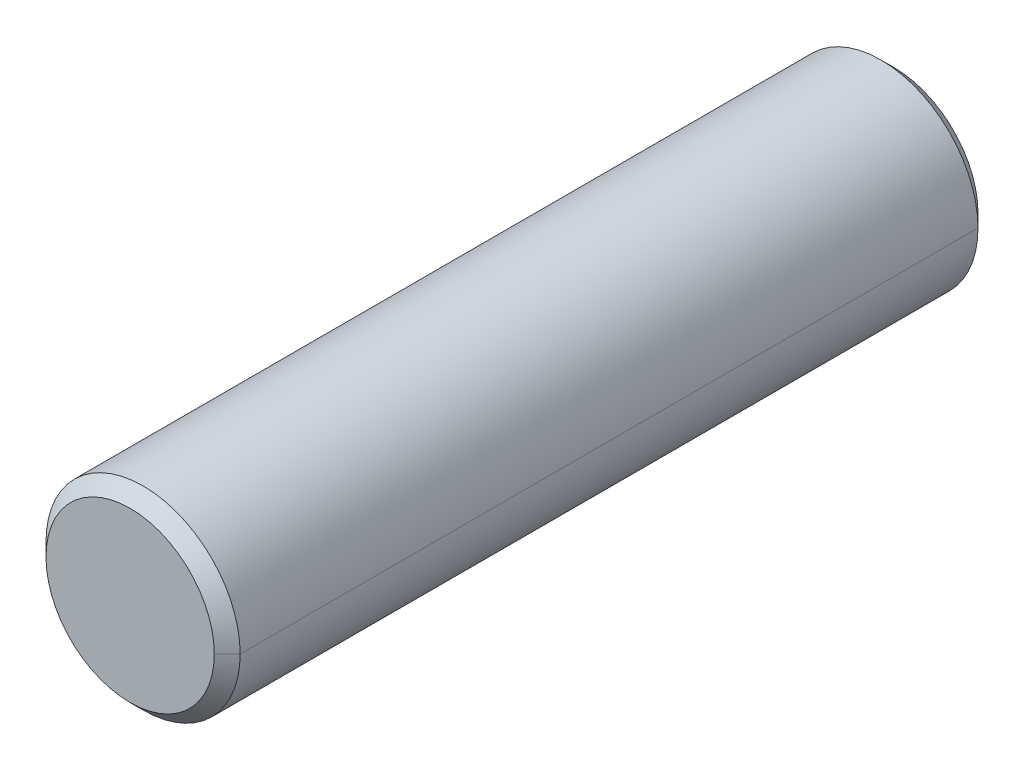
ISO-10303-21;
HEADER;
FILE_DESCRIPTION(('STEP AP214'),'2;1');
FILE_NAME('part.step','',(''),(''),'','','');
FILE_SCHEMA(('AUTOMOTIVE_DESIGN { 1 0 10303 214 1 1 1 1 }'));
ENDSEC;
DATA;
#1=APPLICATION_CONTEXT('core data for automotive mechanical design processes');
#2=APPLICATION_PROTOCOL_DEFINITION('international standard','automotive_design',2000,#1);
#3=PRODUCT_CONTEXT('',#1,'mechanical');
#4=PRODUCT('Part','Part','',(#3));
#5=PRODUCT_RELATED_PRODUCT_CATEGORY('part','',(#4));
#6=PRODUCT_DEFINITION_FORMATION('','',#4);
#7=PRODUCT_DEFINITION_CONTEXT('part definition',#1,'design');
#8=PRODUCT_DEFINITION('design','',#6,#7);
#9=PRODUCT_DEFINITION_SHAPE('','',#8);
#10=(LENGTH_UNIT() NAMED_UNIT(*) SI_UNIT(.MILLI.,.METRE.));
#11=(NAMED_UNIT(*) PLANE_ANGLE_UNIT() SI_UNIT($,.RADIAN.));
#12=(NAMED_UNIT(*) SI_UNIT($,.STERADIAN.) SOLID_ANGLE_UNIT());
#13=UNCERTAINTY_MEASURE_WITH_UNIT(LENGTH_MEASURE(1.E-05),#10,'distance_accuracy_value','');
#14=(GEOMETRIC_REPRESENTATION_CONTEXT(3) GLOBAL_UNCERTAINTY_ASSIGNED_CONTEXT((#13)) GLOBAL_UNIT_ASSIGNED_CONTEXT((#10,
#11,#12)) REPRESENTATION_CONTEXT('',''));
#15=CARTESIAN_POINT('',(0.,0.,0.));
#16=DIRECTION('',(0.,0.,1.));
#17=DIRECTION('',(1.,0.,0.));
#18=AXIS2_PLACEMENT_3D('',#15,#16,#17);
#19=CARTESIAN_POINT('',(0.,0.,-59.));
#20=DIRECTION('',(0.,0.,1.));
#21=DIRECTION('',(1.,0.,0.));
#22=AXIS2_PLACEMENT_3D('',#19,#20,#21);
#23=PLANE('',#22);
#24=CARTESIAN_POINT('',(0.,0.,-59.));
#25=DIRECTION('',(0.,0.,-1.));
#26=DIRECTION('',(-1.,0.,0.));
#27=AXIS2_PLACEMENT_3D('',#24,#25,#26);
#28=CIRCLE('',#27,13.);
#29=CARTESIAN_POINT('',(-12.9999999995967,-3.416070516846E-08,-59.0000000004033));
#30=VERTEX_POINT('',#29);
#31=CARTESIAN_POINT('',(12.9999999995967,3.41607067926625E-08,-59.0000000004033));
#32=VERTEX_POINT('',#31);
#33=EDGE_CURVE('E11',#30,#32,#28,.T.);
#34=ORIENTED_EDGE('',*,*,#33,.T.);
#35=CARTESIAN_POINT('',(0.,0.,-59.));
#36=DIRECTION('',(0.,0.,-1.));
#37=DIRECTION('',(1.,0.,0.));
#38=AXIS2_PLACEMENT_3D('',#35,#36,#37);
#39=CIRCLE('',#38,13.);
#40=EDGE_CURVE('E26',#32,#30,#39,.T.);
#41=ORIENTED_EDGE('',*,*,#40,.T.);
#42=EDGE_LOOP('',(#34,#41));
#43=FACE_BOUND('',#42,.T.);
#44=ADVANCED_FACE('F16',(#43),#23,.F.);
#45=CARTESIAN_POINT('',(0.,0.,-71.));
#46=DIRECTION('',(0.,0.,1.));
#47=DIRECTION('',(0.,-1.,0.));
#48=AXIS2_PLACEMENT_3D('',#45,#46,#47);
#49=CONICAL_SURFACE('',#48,1.,0.785398163397448);
#50=DIRECTION('',(-0.707106781186548,-5.57429692804215E-09,0.707106781186548));
#51=VECTOR('',#50,1.);
#52=CARTESIAN_POINT('',(-12.99999999879,-1.0248211550538E-07,-59.00000000121));
#53=LINE('',#52,#51);
#54=CARTESIAN_POINT('',(-14.999999999651,-2.95621506564165E-08,-57.000000000349));
#55=VERTEX_POINT('',#54);
#56=EDGE_CURVE('E83',#30,#55,#53,.T.);
#57=ORIENTED_EDGE('',*,*,#56,.T.);
#58=CARTESIAN_POINT('',(0.,0.,-57.));
#59=DIRECTION('',(0.,0.,-1.));
#60=DIRECTION('',(-1.,0.,0.));
#61=AXIS2_PLACEMENT_3D('',#58,#59,#60);
#62=CIRCLE('',#61,15.);
#63=CARTESIAN_POINT('',(14.999999999651,2.95621495639745E-08,-57.000000000349));
#64=VERTEX_POINT('',#63);
#65=EDGE_CURVE('E79',#55,#64,#62,.T.);
#66=ORIENTED_EDGE('',*,*,#65,.T.);
#67=DIRECTION('',(0.707106781186548,5.57429301090199E-09,0.707106781186548));
#68=VECTOR('',#67,1.);
#69=CARTESIAN_POINT('',(12.99999999879,1.02482120377988E-07,-59.00000000121));
#70=LINE('',#69,#68);
#71=EDGE_CURVE('E72',#32,#64,#70,.T.);
#72=ORIENTED_EDGE('',*,*,#71,.F.);
#73=ORIENTED_EDGE('',*,*,#33,.F.);
#74=EDGE_LOOP('',(#57,#66,#72,#73));
#75=FACE_BOUND('',#74,.T.);
#76=ADVANCED_FACE('F82',(#75),#49,.T.);
#77=CARTESIAN_POINT('',(0.,0.,-71.));
#78=DIRECTION('',(0.,0.,1.));
#79=DIRECTION('',(0.,-1.,0.));
#80=AXIS2_PLACEMENT_3D('',#77,#78,#79);
#81=CONICAL_SURFACE('',#80,1.,0.785398163397448);
#82=ORIENTED_EDGE('',*,*,#71,.T.);
#83=CARTESIAN_POINT('',(0.,0.,-57.));
#84=DIRECTION('',(0.,0.,-1.));
#85=DIRECTION('',(1.,0.,0.));
#86=AXIS2_PLACEMENT_3D('',#83,#84,#85);
#87=CIRCLE('',#86,15.);
#88=EDGE_CURVE('E64',#64,#55,#87,.T.);
#89=ORIENTED_EDGE('',*,*,#88,.T.);
#90=ORIENTED_EDGE('',*,*,#56,.F.);
#91=ORIENTED_EDGE('',*,*,#40,.F.);
#92=EDGE_LOOP('',(#82,#89,#90,#91));
#93=FACE_BOUND('',#92,.T.);
#94=ADVANCED_FACE('F76',(#93),#81,.T.);
#95=CARTESIAN_POINT('',(0.,0.,-59.));
#96=DIRECTION('',(0.,0.,-1.));
#97=DIRECTION('',(1.,0.,0.));
#98=AXIS2_PLACEMENT_3D('',#95,#96,#97);
#99=CYLINDRICAL_SURFACE('',#98,15.);
#100=DIRECTION('',(0.,0.,1.));
#101=VECTOR('',#100,1.);
#102=CARTESIAN_POINT('',(15.,0.,-57.));
#103=LINE('',#102,#101);
#104=CARTESIAN_POINT('',(14.9999999998025,-2.59445743032624E-08,57.0000000001975));
#105=VERTEX_POINT('',#104);
#106=EDGE_CURVE('E67',#64,#105,#103,.T.);
#107=ORIENTED_EDGE('',*,*,#106,.F.);
#108=ORIENTED_EDGE('',*,*,#65,.F.);
#109=DIRECTION('',(0.,0.,1.));
#110=VECTOR('',#109,1.);
#111=CARTESIAN_POINT('',(-15.,0.,-57.));
#112=LINE('',#111,#110);
#113=CARTESIAN_POINT('',(-14.9999999998025,2.59445764556716E-08,57.0000000001975));
#114=VERTEX_POINT('',#113);
#115=EDGE_CURVE('E69',#55,#114,#112,.T.);
#116=ORIENTED_EDGE('',*,*,#115,.T.);
#117=CARTESIAN_POINT('',(0.,0.,57.));
#118=DIRECTION('',(0.,0.,1.));
#119=DIRECTION('',(1.,0.,0.));
#120=AXIS2_PLACEMENT_3D('',#117,#118,#119);
#121=CIRCLE('',#120,15.);
#122=EDGE_CURVE('E90',#105,#114,#121,.T.);
#123=ORIENTED_EDGE('',*,*,#122,.F.);
#124=EDGE_LOOP('',(#107,#108,#116,#123));
#125=FACE_BOUND('',#124,.T.);
#126=ADVANCED_FACE('F88',(#125),#99,.T.);
#127=CARTESIAN_POINT('',(0.,0.,-59.));
#128=DIRECTION('',(0.,0.,-1.));
#129=DIRECTION('',(1.,0.,0.));
#130=AXIS2_PLACEMENT_3D('',#127,#128,#129);
#131=CYLINDRICAL_SURFACE('',#130,15.);
#132=ORIENTED_EDGE('',*,*,#115,.F.);
#133=ORIENTED_EDGE('',*,*,#88,.F.);
#134=ORIENTED_EDGE('',*,*,#106,.T.);
#135=CARTESIAN_POINT('',(0.,0.,57.));
#136=DIRECTION('',(0.,0.,1.));
#137=DIRECTION('',(-1.,0.,0.));
#138=AXIS2_PLACEMENT_3D('',#135,#136,#137);
#139=CIRCLE('',#138,15.);
#140=EDGE_CURVE('E20',#114,#105,#139,.T.);
#141=ORIENTED_EDGE('',*,*,#140,.F.);
#142=EDGE_LOOP('',(#132,#133,#134,#141));
#143=FACE_BOUND('',#142,.T.);
#144=ADVANCED_FACE('F65',(#143),#131,.T.);
#145=CARTESIAN_POINT('',(0.,0.,71.));
#146=DIRECTION('',(0.,0.,-1.));
#147=DIRECTION('',(0.,-1.,0.));
#148=AXIS2_PLACEMENT_3D('',#145,#146,#147);
#149=CONICAL_SURFACE('',#148,1.,0.785398163397448);
#150=DIRECTION('',(0.707106781186548,-4.89215567368909E-09,-0.707106781186548));
#151=VECTOR('',#150,1.);
#152=CARTESIAN_POINT('',(12.9999999993154,-8.99411877338944E-08,59.0000000006846));
#153=LINE('',#152,#151);
#154=CARTESIAN_POINT('',(12.9999999997718,-2.99803959112981E-08,59.0000000002282));
#155=VERTEX_POINT('',#154);
#156=EDGE_CURVE('E92',#155,#105,#153,.T.);
#157=ORIENTED_EDGE('',*,*,#156,.T.);
#158=ORIENTED_EDGE('',*,*,#122,.T.);
#159=DIRECTION('',(-0.707106781186547,4.89215440952414E-09,-0.707106781186548));
#160=VECTOR('',#159,1.);
#161=CARTESIAN_POINT('',(-12.9999999993154,8.99411980821598E-08,59.0000000006846));
#162=LINE('',#161,#160);
#163=CARTESIAN_POINT('',(-12.9999999997718,2.99803993607199E-08,59.0000000002282));
#164=VERTEX_POINT('',#163);
#165=EDGE_CURVE('E102',#164,#114,#162,.T.);
#166=ORIENTED_EDGE('',*,*,#165,.F.);
#167=CARTESIAN_POINT('',(0.,0.,59.));
#168=DIRECTION('',(0.,0.,1.));
#169=DIRECTION('',(1.,0.,0.));
#170=AXIS2_PLACEMENT_3D('',#167,#168,#169);
#171=CIRCLE('',#170,13.);
#172=EDGE_CURVE('E49',#155,#164,#171,.T.);
#173=ORIENTED_EDGE('',*,*,#172,.F.);
#174=EDGE_LOOP('',(#157,#158,#166,#173));
#175=FACE_BOUND('',#174,.T.);
#176=ADVANCED_FACE('F130',(#175),#149,.T.);
#177=CARTESIAN_POINT('',(0.,0.,71.));
#178=DIRECTION('',(0.,0.,-1.));
#179=DIRECTION('',(0.,-1.,0.));
#180=AXIS2_PLACEMENT_3D('',#177,#178,#179);
#181=CONICAL_SURFACE('',#180,1.,0.785398163397448);
#182=ORIENTED_EDGE('',*,*,#165,.T.);
#183=ORIENTED_EDGE('',*,*,#140,.T.);
#184=ORIENTED_EDGE('',*,*,#156,.F.);
#185=CARTESIAN_POINT('',(0.,0.,59.));
#186=DIRECTION('',(0.,0.,1.));
#187=DIRECTION('',(-1.,0.,0.));
#188=AXIS2_PLACEMENT_3D('',#185,#186,#187);
#189=CIRCLE('',#188,13.);
#190=EDGE_CURVE('E114',#164,#155,#189,.T.);
#191=ORIENTED_EDGE('',*,*,#190,.F.);
#192=EDGE_LOOP('',(#182,#183,#184,#191));
#193=FACE_BOUND('',#192,.T.);
#194=ADVANCED_FACE('F18',(#193),#181,.T.);
#195=CARTESIAN_POINT('',(0.,0.,59.));
#196=DIRECTION('',(0.,0.,1.));
#197=DIRECTION('',(1.,0.,0.));
#198=AXIS2_PLACEMENT_3D('',#195,#196,#197);
#199=PLANE('',#198);
#200=ORIENTED_EDGE('',*,*,#172,.T.);
#201=ORIENTED_EDGE('',*,*,#190,.T.);
#202=EDGE_LOOP('',(#200,#201));
#203=FACE_BOUND('',#202,.T.);
#204=ADVANCED_FACE('F129',(#203),#199,.T.);
#205=CLOSED_SHELL('',(#44,#76,#94,#126,#144,#176,#194,#204));
#206=MANIFOLD_SOLID_BREP('B1',#205);
#207=ADVANCED_BREP_SHAPE_REPRESENTATION('',(#18,#206),#14);
#208=SHAPE_DEFINITION_REPRESENTATION(#9,#207);
ENDSEC;
END-ISO-10303-21;
